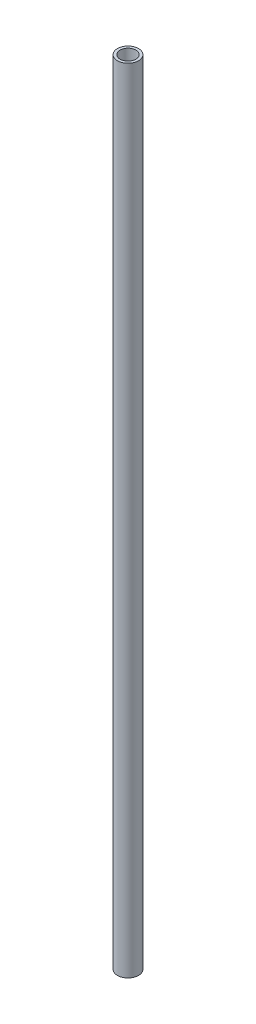
ISO-10303-21;
HEADER;
FILE_DESCRIPTION(('STEP AP214'),'2;1');
FILE_NAME('part.step','',(''),(''),'','','');
FILE_SCHEMA(('AUTOMOTIVE_DESIGN { 1 0 10303 214 1 1 1 1 }'));
ENDSEC;
DATA;
#1=APPLICATION_CONTEXT('core data for automotive mechanical design processes');
#2=APPLICATION_PROTOCOL_DEFINITION('international standard','automotive_design',2000,#1);
#3=PRODUCT_CONTEXT('',#1,'mechanical');
#4=PRODUCT('Part','Part','',(#3));
#5=PRODUCT_RELATED_PRODUCT_CATEGORY('part','',(#4));
#6=PRODUCT_DEFINITION_FORMATION('','',#4);
#7=PRODUCT_DEFINITION_CONTEXT('part definition',#1,'design');
#8=PRODUCT_DEFINITION('design','',#6,#7);
#9=PRODUCT_DEFINITION_SHAPE('','',#8);
#10=(LENGTH_UNIT() NAMED_UNIT(*) SI_UNIT(.MILLI.,.METRE.));
#11=(NAMED_UNIT(*) PLANE_ANGLE_UNIT() SI_UNIT($,.RADIAN.));
#12=(NAMED_UNIT(*) SI_UNIT($,.STERADIAN.) SOLID_ANGLE_UNIT());
#13=UNCERTAINTY_MEASURE_WITH_UNIT(LENGTH_MEASURE(1.E-05),#10,'distance_accuracy_value','');
#14=(GEOMETRIC_REPRESENTATION_CONTEXT(3) GLOBAL_UNCERTAINTY_ASSIGNED_CONTEXT((#13)) GLOBAL_UNIT_ASSIGNED_CONTEXT((#10,
#11,#12)) REPRESENTATION_CONTEXT('',''));
#15=CARTESIAN_POINT('',(0.,0.,0.));
#16=DIRECTION('',(0.,0.,1.));
#17=DIRECTION('',(1.,0.,0.));
#18=AXIS2_PLACEMENT_3D('',#15,#16,#17);
#19=CARTESIAN_POINT('',(0.,300.,0.));
#20=DIRECTION('',(0.,1.,0.));
#21=DIRECTION('',(0.,0.,1.));
#22=AXIS2_PLACEMENT_3D('',#19,#20,#21);
#23=PLANE('',#22);
#24=CARTESIAN_POINT('',(0.,300.,0.));
#25=DIRECTION('',(0.,1.,0.));
#26=DIRECTION('',(0.,0.,1.));
#27=AXIS2_PLACEMENT_3D('',#24,#25,#26);
#28=CIRCLE('',#27,4.);
#29=CARTESIAN_POINT('',(0.,300.,4.));
#30=VERTEX_POINT('',#29);
#31=EDGE_CURVE('E10',#30,#30,#28,.T.);
#32=ORIENTED_EDGE('',*,*,#31,.T.);
#33=EDGE_LOOP('',(#32));
#34=FACE_BOUND('',#33,.T.);
#35=CARTESIAN_POINT('',(0.,300.,0.));
#36=DIRECTION('',(0.,1.,0.));
#37=DIRECTION('',(0.,0.,1.));
#38=AXIS2_PLACEMENT_3D('',#35,#36,#37);
#39=CIRCLE('',#38,3.);
#40=CARTESIAN_POINT('',(0.,300.,3.));
#41=VERTEX_POINT('',#40);
#42=EDGE_CURVE('E44',#41,#41,#39,.T.);
#43=ORIENTED_EDGE('',*,*,#42,.F.);
#44=EDGE_LOOP('',(#43));
#45=FACE_BOUND('',#44,.T.);
#46=ADVANCED_FACE('F33',(#34,#45),#23,.T.);
#47=CARTESIAN_POINT('',(0.,0.,0.));
#48=DIRECTION('',(0.,1.,0.));
#49=DIRECTION('',(0.,0.,1.));
#50=AXIS2_PLACEMENT_3D('',#47,#48,#49);
#51=PLANE('',#50);
#52=CARTESIAN_POINT('',(0.,0.,0.));
#53=DIRECTION('',(0.,1.,0.));
#54=DIRECTION('',(0.,0.,1.));
#55=AXIS2_PLACEMENT_3D('',#52,#53,#54);
#56=CIRCLE('',#55,4.);
#57=CARTESIAN_POINT('',(0.,0.,4.));
#58=VERTEX_POINT('',#57);
#59=EDGE_CURVE('E37',#58,#58,#56,.T.);
#60=ORIENTED_EDGE('',*,*,#59,.F.);
#61=EDGE_LOOP('',(#60));
#62=FACE_BOUND('',#61,.T.);
#63=CARTESIAN_POINT('',(0.,0.,0.));
#64=DIRECTION('',(0.,1.,0.));
#65=DIRECTION('',(0.,0.,1.));
#66=AXIS2_PLACEMENT_3D('',#63,#64,#65);
#67=CIRCLE('',#66,3.);
#68=CARTESIAN_POINT('',(0.,0.,3.));
#69=VERTEX_POINT('',#68);
#70=EDGE_CURVE('E46',#69,#69,#67,.T.);
#71=ORIENTED_EDGE('',*,*,#70,.T.);
#72=EDGE_LOOP('',(#71));
#73=FACE_BOUND('',#72,.T.);
#74=ADVANCED_FACE('F56',(#62,#73),#51,.F.);
#75=CARTESIAN_POINT('',(0.,300.,0.));
#76=DIRECTION('',(0.,-1.,0.));
#77=DIRECTION('',(0.,0.,-1.));
#78=AXIS2_PLACEMENT_3D('',#75,#76,#77);
#79=CYLINDRICAL_SURFACE('',#78,4.);
#80=ORIENTED_EDGE('',*,*,#31,.F.);
#81=EDGE_LOOP('',(#80));
#82=FACE_BOUND('',#81,.T.);
#83=ORIENTED_EDGE('',*,*,#59,.T.);
#84=EDGE_LOOP('',(#83));
#85=FACE_BOUND('',#84,.T.);
#86=ADVANCED_FACE('F35',(#82,#85),#79,.T.);
#87=CARTESIAN_POINT('',(0.,300.,0.));
#88=DIRECTION('',(0.,-1.,0.));
#89=DIRECTION('',(0.,0.,-1.));
#90=AXIS2_PLACEMENT_3D('',#87,#88,#89);
#91=CYLINDRICAL_SURFACE('',#90,3.);
#92=ORIENTED_EDGE('',*,*,#42,.T.);
#93=EDGE_LOOP('',(#92));
#94=FACE_BOUND('',#93,.T.);
#95=ORIENTED_EDGE('',*,*,#70,.F.);
#96=EDGE_LOOP('',(#95));
#97=FACE_BOUND('',#96,.T.);
#98=ADVANCED_FACE('F52',(#94,#97),#91,.F.);
#99=CLOSED_SHELL('',(#46,#74,#86,#98));
#100=MANIFOLD_SOLID_BREP('B2',#99);
#101=ADVANCED_BREP_SHAPE_REPRESENTATION('',(#18,#100),#14);
#102=SHAPE_DEFINITION_REPRESENTATION(#9,#101);
ENDSEC;
END-ISO-10303-21;
